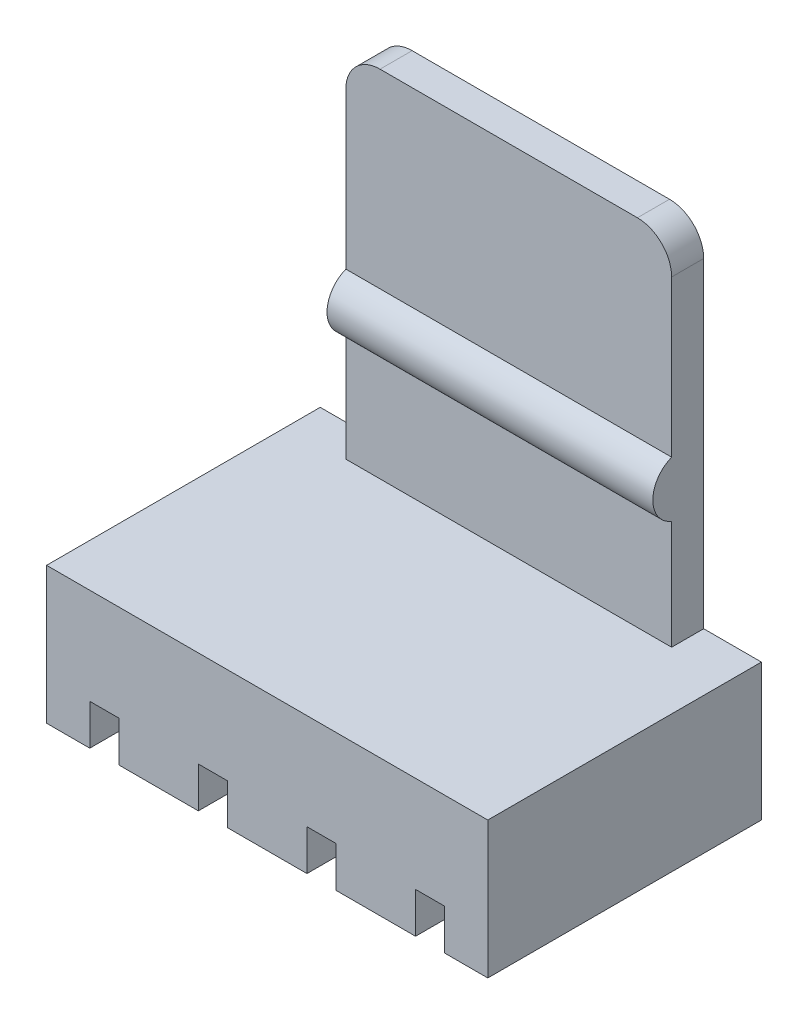
ISO-10303-21;
HEADER;
FILE_DESCRIPTION(('STEP AP214'),'2;1');
FILE_NAME('part.step','',(''),(''),'','','');
FILE_SCHEMA(('AUTOMOTIVE_DESIGN { 1 0 10303 214 1 1 1 1 }'));
ENDSEC;
DATA;
#1=APPLICATION_CONTEXT('core data for automotive mechanical design processes');
#2=APPLICATION_PROTOCOL_DEFINITION('international standard','automotive_design',2000,#1);
#3=PRODUCT_CONTEXT('',#1,'mechanical');
#4=PRODUCT('Part','Part','',(#3));
#5=PRODUCT_RELATED_PRODUCT_CATEGORY('part','',(#4));
#6=PRODUCT_DEFINITION_FORMATION('','',#4);
#7=PRODUCT_DEFINITION_CONTEXT('part definition',#1,'design');
#8=PRODUCT_DEFINITION('design','',#6,#7);
#9=PRODUCT_DEFINITION_SHAPE('','',#8);
#10=(LENGTH_UNIT() NAMED_UNIT(*) SI_UNIT(.MILLI.,.METRE.));
#11=(NAMED_UNIT(*) PLANE_ANGLE_UNIT() SI_UNIT($,.RADIAN.));
#12=(NAMED_UNIT(*) SI_UNIT($,.STERADIAN.) SOLID_ANGLE_UNIT());
#13=UNCERTAINTY_MEASURE_WITH_UNIT(LENGTH_MEASURE(1.E-05),#10,'distance_accuracy_value','');
#14=(GEOMETRIC_REPRESENTATION_CONTEXT(3) GLOBAL_UNCERTAINTY_ASSIGNED_CONTEXT((#13)) GLOBAL_UNIT_ASSIGNED_CONTEXT((#10,
#11,#12)) REPRESENTATION_CONTEXT('',''));
#15=CARTESIAN_POINT('',(0.,0.,0.));
#16=DIRECTION('',(0.,0.,1.));
#17=DIRECTION('',(1.,0.,0.));
#18=AXIS2_PLACEMENT_3D('',#15,#16,#17);
#19=CARTESIAN_POINT('',(3.81,0.95,0.));
#20=DIRECTION('',(0.,1.,0.));
#21=DIRECTION('',(0.,0.,1.));
#22=AXIS2_PLACEMENT_3D('',#19,#20,#21);
#23=PLANE('',#22);
#24=DIRECTION('',(1.,0.,0.));
#25=VECTOR('',#24,1.);
#26=CARTESIAN_POINT('',(3.81,0.95,3.2));
#27=LINE('',#26,#25);
#28=CARTESIAN_POINT('',(3.47,0.95,3.2));
#29=VERTEX_POINT('',#28);
#30=CARTESIAN_POINT('',(4.15,0.95,3.2));
#31=VERTEX_POINT('',#30);
#32=EDGE_CURVE('E396',#29,#31,#27,.T.);
#33=ORIENTED_EDGE('',*,*,#32,.F.);
#34=DIRECTION('',(0.,0.,1.));
#35=VECTOR('',#34,1.);
#36=CARTESIAN_POINT('',(3.47,0.95,-3.2));
#37=LINE('',#36,#35);
#38=CARTESIAN_POINT('',(3.47,0.95,-3.2));
#39=VERTEX_POINT('',#38);
#40=EDGE_CURVE('E343',#29,#39,#37,.F.);
#41=ORIENTED_EDGE('',*,*,#40,.T.);
#42=DIRECTION('',(1.,0.,0.));
#43=VECTOR('',#42,1.);
#44=CARTESIAN_POINT('',(3.81,0.95,-3.2));
#45=LINE('',#44,#43);
#46=CARTESIAN_POINT('',(4.15,0.95,-3.2));
#47=VERTEX_POINT('',#46);
#48=EDGE_CURVE('E398',#47,#39,#45,.F.);
#49=ORIENTED_EDGE('',*,*,#48,.F.);
#50=DIRECTION('',(0.,0.,-1.));
#51=VECTOR('',#50,1.);
#52=CARTESIAN_POINT('',(4.15,0.95,3.2));
#53=LINE('',#52,#51);
#54=EDGE_CURVE('E373',#47,#31,#53,.F.);
#55=ORIENTED_EDGE('',*,*,#54,.T.);
#56=EDGE_LOOP('',(#33,#41,#49,#55));
#57=FACE_BOUND('',#56,.T.);
#58=ADVANCED_FACE('F17',(#57),#23,.F.);
#59=CARTESIAN_POINT('',(1.27,0.95,0.));
#60=DIRECTION('',(0.,1.,0.));
#61=DIRECTION('',(0.,0.,1.));
#62=AXIS2_PLACEMENT_3D('',#59,#60,#61);
#63=PLANE('',#62);
#64=DIRECTION('',(1.,0.,0.));
#65=VECTOR('',#64,1.);
#66=CARTESIAN_POINT('',(1.27,0.95,-3.2));
#67=LINE('',#66,#65);
#68=CARTESIAN_POINT('',(1.61,0.95,-3.2));
#69=VERTEX_POINT('',#68);
#70=CARTESIAN_POINT('',(0.93,0.95,-3.2));
#71=VERTEX_POINT('',#70);
#72=EDGE_CURVE('E392',#69,#71,#67,.F.);
#73=ORIENTED_EDGE('',*,*,#72,.F.);
#74=DIRECTION('',(0.,0.,-1.));
#75=VECTOR('',#74,1.);
#76=CARTESIAN_POINT('',(1.61,0.95,3.2));
#77=LINE('',#76,#75);
#78=CARTESIAN_POINT('',(1.61,0.95,3.2));
#79=VERTEX_POINT('',#78);
#80=EDGE_CURVE('E346',#69,#79,#77,.F.);
#81=ORIENTED_EDGE('',*,*,#80,.T.);
#82=DIRECTION('',(1.,0.,0.));
#83=VECTOR('',#82,1.);
#84=CARTESIAN_POINT('',(1.27,0.95,3.2));
#85=LINE('',#84,#83);
#86=CARTESIAN_POINT('',(0.93,0.95,3.2));
#87=VERTEX_POINT('',#86);
#88=EDGE_CURVE('E394',#87,#79,#85,.T.);
#89=ORIENTED_EDGE('',*,*,#88,.F.);
#90=DIRECTION('',(0.,0.,1.));
#91=VECTOR('',#90,1.);
#92=CARTESIAN_POINT('',(0.93,0.95,-3.2));
#93=LINE('',#92,#91);
#94=EDGE_CURVE('E338',#87,#71,#93,.F.);
#95=ORIENTED_EDGE('',*,*,#94,.T.);
#96=EDGE_LOOP('',(#73,#81,#89,#95));
#97=FACE_BOUND('',#96,.T.);
#98=ADVANCED_FACE('F492',(#97),#63,.F.);
#99=CARTESIAN_POINT('',(-3.81,0.95,0.));
#100=DIRECTION('',(0.,1.,0.));
#101=DIRECTION('',(0.,0.,1.));
#102=AXIS2_PLACEMENT_3D('',#99,#100,#101);
#103=PLANE('',#102);
#104=DIRECTION('',(1.,0.,0.));
#105=VECTOR('',#104,1.);
#106=CARTESIAN_POINT('',(-3.81,0.95,-3.2));
#107=LINE('',#106,#105);
#108=CARTESIAN_POINT('',(-3.47,0.95,-3.2));
#109=VERTEX_POINT('',#108);
#110=CARTESIAN_POINT('',(-4.15,0.95,-3.2));
#111=VERTEX_POINT('',#110);
#112=EDGE_CURVE('E388',#109,#111,#107,.F.);
#113=ORIENTED_EDGE('',*,*,#112,.F.);
#114=DIRECTION('',(0.,0.,-1.));
#115=VECTOR('',#114,1.);
#116=CARTESIAN_POINT('',(-3.47,0.95,3.2));
#117=LINE('',#116,#115);
#118=CARTESIAN_POINT('',(-3.47,0.95,3.2));
#119=VERTEX_POINT('',#118);
#120=EDGE_CURVE('E326',#109,#119,#117,.F.);
#121=ORIENTED_EDGE('',*,*,#120,.T.);
#122=DIRECTION('',(1.,0.,0.));
#123=VECTOR('',#122,1.);
#124=CARTESIAN_POINT('',(-3.81,0.95,3.2));
#125=LINE('',#124,#123);
#126=CARTESIAN_POINT('',(-4.15,0.95,3.2));
#127=VERTEX_POINT('',#126);
#128=EDGE_CURVE('E390',#127,#119,#125,.T.);
#129=ORIENTED_EDGE('',*,*,#128,.F.);
#130=DIRECTION('',(0.,0.,1.));
#131=VECTOR('',#130,1.);
#132=CARTESIAN_POINT('',(-4.15,0.95,-3.2));
#133=LINE('',#132,#131);
#134=EDGE_CURVE('E379',#127,#111,#133,.F.);
#135=ORIENTED_EDGE('',*,*,#134,.T.);
#136=EDGE_LOOP('',(#113,#121,#129,#135));
#137=FACE_BOUND('',#136,.T.);
#138=ADVANCED_FACE('F527',(#137),#103,.F.);
#139=CARTESIAN_POINT('',(-1.27,0.95,0.));
#140=DIRECTION('',(0.,1.,0.));
#141=DIRECTION('',(0.,0.,1.));
#142=AXIS2_PLACEMENT_3D('',#139,#140,#141);
#143=PLANE('',#142);
#144=DIRECTION('',(1.,0.,0.));
#145=VECTOR('',#144,1.);
#146=CARTESIAN_POINT('',(-1.27,0.95,3.2));
#147=LINE('',#146,#145);
#148=CARTESIAN_POINT('',(-1.61,0.95,3.2));
#149=VERTEX_POINT('',#148);
#150=CARTESIAN_POINT('',(-0.93,0.95,3.2));
#151=VERTEX_POINT('',#150);
#152=EDGE_CURVE('E384',#149,#151,#147,.T.);
#153=ORIENTED_EDGE('',*,*,#152,.F.);
#154=DIRECTION('',(0.,0.,1.));
#155=VECTOR('',#154,1.);
#156=CARTESIAN_POINT('',(-1.61,0.95,-3.2));
#157=LINE('',#156,#155);
#158=CARTESIAN_POINT('',(-1.61,0.95,-3.2));
#159=VERTEX_POINT('',#158);
#160=EDGE_CURVE('E323',#149,#159,#157,.F.);
#161=ORIENTED_EDGE('',*,*,#160,.T.);
#162=DIRECTION('',(1.,0.,0.));
#163=VECTOR('',#162,1.);
#164=CARTESIAN_POINT('',(-1.27,0.95,-3.2));
#165=LINE('',#164,#163);
#166=CARTESIAN_POINT('',(-0.93,0.95,-3.2));
#167=VERTEX_POINT('',#166);
#168=EDGE_CURVE('E386',#167,#159,#165,.F.);
#169=ORIENTED_EDGE('',*,*,#168,.F.);
#170=DIRECTION('',(0.,0.,-1.));
#171=VECTOR('',#170,1.);
#172=CARTESIAN_POINT('',(-0.93,0.95,3.2));
#173=LINE('',#172,#171);
#174=EDGE_CURVE('E331',#167,#151,#173,.F.);
#175=ORIENTED_EDGE('',*,*,#174,.T.);
#176=EDGE_LOOP('',(#153,#161,#169,#175));
#177=FACE_BOUND('',#176,.T.);
#178=ADVANCED_FACE('F508',(#177),#143,.F.);
#179=CARTESIAN_POINT('',(-4.15,0.,-3.2));
#180=DIRECTION('',(-1.,0.,0.));
#181=DIRECTION('',(0.,0.,1.));
#182=AXIS2_PLACEMENT_3D('',#179,#180,#181);
#183=PLANE('',#182);
#184=DIRECTION('',(0.,1.,0.));
#185=VECTOR('',#184,1.);
#186=CARTESIAN_POINT('',(-4.15,0.,-3.2));
#187=LINE('',#186,#185);
#188=CARTESIAN_POINT('',(-4.15,0.,-3.2));
#189=VERTEX_POINT('',#188);
#190=EDGE_CURVE('E210',#111,#189,#187,.F.);
#191=ORIENTED_EDGE('',*,*,#190,.F.);
#192=ORIENTED_EDGE('',*,*,#134,.F.);
#193=DIRECTION('',(0.,1.,0.));
#194=VECTOR('',#193,1.);
#195=CARTESIAN_POINT('',(-4.15,0.,3.2));
#196=LINE('',#195,#194);
#197=CARTESIAN_POINT('',(-4.15,0.,3.2));
#198=VERTEX_POINT('',#197);
#199=EDGE_CURVE('E382',#198,#127,#196,.T.);
#200=ORIENTED_EDGE('',*,*,#199,.F.);
#201=DIRECTION('',(0.,0.,1.));
#202=VECTOR('',#201,1.);
#203=CARTESIAN_POINT('',(-4.15,0.,0.));
#204=LINE('',#203,#202);
#205=EDGE_CURVE('E218',#198,#189,#204,.F.);
#206=ORIENTED_EDGE('',*,*,#205,.T.);
#207=EDGE_LOOP('',(#191,#192,#200,#206));
#208=FACE_BOUND('',#207,.T.);
#209=ADVANCED_FACE('F533',(#208),#183,.F.);
#210=CARTESIAN_POINT('',(1.905,6.4,-2.70980762113533));
#211=DIRECTION('',(1.,0.,0.));
#212=DIRECTION('',(0.,1.,0.));
#213=AXIS2_PLACEMENT_3D('',#210,#211,#212);
#214=CYLINDRICAL_SURFACE('',#213,0.7);
#215=CARTESIAN_POINT('',(3.81,6.4,-2.70980762113533));
#216=DIRECTION('',(1.,0.,0.));
#217=DIRECTION('',(0.,1.,0.));
#218=AXIS2_PLACEMENT_3D('',#215,#216,#217);
#219=CIRCLE('',#218,0.7);
#220=CARTESIAN_POINT('',(3.81,5.75,-2.45));
#221=VERTEX_POINT('',#220);
#222=CARTESIAN_POINT('',(3.81,7.05,-2.45));
#223=VERTEX_POINT('',#222);
#224=EDGE_CURVE('E209',#221,#223,#219,.F.);
#225=ORIENTED_EDGE('',*,*,#224,.T.);
#226=DIRECTION('',(1.,0.,0.));
#227=VECTOR('',#226,1.);
#228=CARTESIAN_POINT('',(0.,7.05,-2.45));
#229=LINE('',#228,#227);
#230=CARTESIAN_POINT('',(-3.81,7.05,-2.45));
#231=VERTEX_POINT('',#230);
#232=EDGE_CURVE('E207',#231,#223,#229,.T.);
#233=ORIENTED_EDGE('',*,*,#232,.F.);
#234=CARTESIAN_POINT('',(-3.81,6.4,-2.70980762113533));
#235=DIRECTION('',(1.,0.,0.));
#236=DIRECTION('',(0.,1.,0.));
#237=AXIS2_PLACEMENT_3D('',#234,#235,#236);
#238=CIRCLE('',#237,0.7);
#239=CARTESIAN_POINT('',(-3.81,5.75,-2.45));
#240=VERTEX_POINT('',#239);
#241=EDGE_CURVE('E20',#231,#240,#238,.T.);
#242=ORIENTED_EDGE('',*,*,#241,.T.);
#243=DIRECTION('',(1.,0.,0.));
#244=VECTOR('',#243,1.);
#245=CARTESIAN_POINT('',(0.,5.75,-2.45));
#246=LINE('',#245,#244);
#247=EDGE_CURVE('E204',#221,#240,#246,.F.);
#248=ORIENTED_EDGE('',*,*,#247,.F.);
#249=EDGE_LOOP('',(#225,#233,#242,#248));
#250=FACE_BOUND('',#249,.T.);
#251=ADVANCED_FACE('F203',(#250),#214,.T.);
#252=CARTESIAN_POINT('',(4.15,0.,3.2));
#253=DIRECTION('',(1.,0.,0.));
#254=DIRECTION('',(0.,0.,-1.));
#255=AXIS2_PLACEMENT_3D('',#252,#253,#254);
#256=PLANE('',#255);
#257=DIRECTION('',(0.,1.,0.));
#258=VECTOR('',#257,1.);
#259=CARTESIAN_POINT('',(4.15,0.,3.2));
#260=LINE('',#259,#258);
#261=CARTESIAN_POINT('',(4.15,0.,3.2));
#262=VERTEX_POINT('',#261);
#263=EDGE_CURVE('E351',#31,#262,#260,.F.);
#264=ORIENTED_EDGE('',*,*,#263,.F.);
#265=ORIENTED_EDGE('',*,*,#54,.F.);
#266=DIRECTION('',(0.,1.,0.));
#267=VECTOR('',#266,1.);
#268=CARTESIAN_POINT('',(4.15,0.,-3.2));
#269=LINE('',#268,#267);
#270=CARTESIAN_POINT('',(4.15,0.,-3.2));
#271=VERTEX_POINT('',#270);
#272=EDGE_CURVE('E376',#271,#47,#269,.T.);
#273=ORIENTED_EDGE('',*,*,#272,.F.);
#274=DIRECTION('',(0.,0.,1.));
#275=VECTOR('',#274,1.);
#276=CARTESIAN_POINT('',(4.15,0.,0.));
#277=LINE('',#276,#275);
#278=EDGE_CURVE('E296',#271,#262,#277,.T.);
#279=ORIENTED_EDGE('',*,*,#278,.T.);
#280=EDGE_LOOP('',(#264,#265,#273,#279));
#281=FACE_BOUND('',#280,.T.);
#282=ADVANCED_FACE('F470',(#281),#256,.F.);
#283=CARTESIAN_POINT('',(1.61,0.,3.2));
#284=DIRECTION('',(1.,0.,0.));
#285=DIRECTION('',(0.,0.,-1.));
#286=AXIS2_PLACEMENT_3D('',#283,#284,#285);
#287=PLANE('',#286);
#288=DIRECTION('',(0.,1.,0.));
#289=VECTOR('',#288,1.);
#290=CARTESIAN_POINT('',(1.61,0.,3.2));
#291=LINE('',#290,#289);
#292=CARTESIAN_POINT('',(1.61,0.,3.2));
#293=VERTEX_POINT('',#292);
#294=EDGE_CURVE('E273',#79,#293,#291,.F.);
#295=ORIENTED_EDGE('',*,*,#294,.F.);
#296=ORIENTED_EDGE('',*,*,#80,.F.);
#297=DIRECTION('',(0.,1.,0.));
#298=VECTOR('',#297,1.);
#299=CARTESIAN_POINT('',(1.61,0.,-3.2));
#300=LINE('',#299,#298);
#301=CARTESIAN_POINT('',(1.61,0.,-3.2));
#302=VERTEX_POINT('',#301);
#303=EDGE_CURVE('E349',#302,#69,#300,.T.);
#304=ORIENTED_EDGE('',*,*,#303,.F.);
#305=DIRECTION('',(0.,0.,1.));
#306=VECTOR('',#305,1.);
#307=CARTESIAN_POINT('',(1.61,0.,0.));
#308=LINE('',#307,#306);
#309=EDGE_CURVE('E268',#302,#293,#308,.T.);
#310=ORIENTED_EDGE('',*,*,#309,.T.);
#311=EDGE_LOOP('',(#295,#296,#304,#310));
#312=FACE_BOUND('',#311,.T.);
#313=ADVANCED_FACE('F488',(#312),#287,.F.);
#314=CARTESIAN_POINT('',(3.47,0.,-3.2));
#315=DIRECTION('',(-1.,0.,0.));
#316=DIRECTION('',(0.,0.,1.));
#317=AXIS2_PLACEMENT_3D('',#314,#315,#316);
#318=PLANE('',#317);
#319=DIRECTION('',(0.,1.,0.));
#320=VECTOR('',#319,1.);
#321=CARTESIAN_POINT('',(3.47,0.,-3.2));
#322=LINE('',#321,#320);
#323=CARTESIAN_POINT('',(3.47,0.,-3.2));
#324=VERTEX_POINT('',#323);
#325=EDGE_CURVE('E341',#39,#324,#322,.F.);
#326=ORIENTED_EDGE('',*,*,#325,.F.);
#327=ORIENTED_EDGE('',*,*,#40,.F.);
#328=DIRECTION('',(0.,1.,0.));
#329=VECTOR('',#328,1.);
#330=CARTESIAN_POINT('',(3.47,0.,3.2));
#331=LINE('',#330,#329);
#332=CARTESIAN_POINT('',(3.47,0.,3.2));
#333=VERTEX_POINT('',#332);
#334=EDGE_CURVE('E270',#333,#29,#331,.T.);
#335=ORIENTED_EDGE('',*,*,#334,.F.);
#336=DIRECTION('',(0.,0.,1.));
#337=VECTOR('',#336,1.);
#338=CARTESIAN_POINT('',(3.47,0.,0.));
#339=LINE('',#338,#337);
#340=EDGE_CURVE('E262',#333,#324,#339,.F.);
#341=ORIENTED_EDGE('',*,*,#340,.T.);
#342=EDGE_LOOP('',(#326,#327,#335,#341));
#343=FACE_BOUND('',#342,.T.);
#344=ADVANCED_FACE('F478',(#343),#318,.F.);
#345=CARTESIAN_POINT('',(0.93,0.,-3.2));
#346=DIRECTION('',(-1.,0.,0.));
#347=DIRECTION('',(0.,0.,1.));
#348=AXIS2_PLACEMENT_3D('',#345,#346,#347);
#349=PLANE('',#348);
#350=DIRECTION('',(0.,1.,0.));
#351=VECTOR('',#350,1.);
#352=CARTESIAN_POINT('',(0.93,0.,-3.2));
#353=LINE('',#352,#351);
#354=CARTESIAN_POINT('',(0.93,0.,-3.2));
#355=VERTEX_POINT('',#354);
#356=EDGE_CURVE('E336',#71,#355,#353,.F.);
#357=ORIENTED_EDGE('',*,*,#356,.F.);
#358=ORIENTED_EDGE('',*,*,#94,.F.);
#359=DIRECTION('',(0.,1.,0.));
#360=VECTOR('',#359,1.);
#361=CARTESIAN_POINT('',(0.93,0.,3.2));
#362=LINE('',#361,#360);
#363=CARTESIAN_POINT('',(0.93,0.,3.2));
#364=VERTEX_POINT('',#363);
#365=EDGE_CURVE('E276',#364,#87,#362,.T.);
#366=ORIENTED_EDGE('',*,*,#365,.F.);
#367=DIRECTION('',(0.,0.,1.));
#368=VECTOR('',#367,1.);
#369=CARTESIAN_POINT('',(0.93,0.,0.));
#370=LINE('',#369,#368);
#371=EDGE_CURVE('E256',#364,#355,#370,.F.);
#372=ORIENTED_EDGE('',*,*,#371,.T.);
#373=EDGE_LOOP('',(#357,#358,#366,#372));
#374=FACE_BOUND('',#373,.T.);
#375=ADVANCED_FACE('F497',(#374),#349,.F.);
#376=CARTESIAN_POINT('',(-0.93,0.,3.2));
#377=DIRECTION('',(1.,0.,0.));
#378=DIRECTION('',(0.,0.,-1.));
#379=AXIS2_PLACEMENT_3D('',#376,#377,#378);
#380=PLANE('',#379);
#381=DIRECTION('',(0.,1.,0.));
#382=VECTOR('',#381,1.);
#383=CARTESIAN_POINT('',(-0.93,0.,3.2));
#384=LINE('',#383,#382);
#385=CARTESIAN_POINT('',(-0.93,0.,3.2));
#386=VERTEX_POINT('',#385);
#387=EDGE_CURVE('E279',#151,#386,#384,.F.);
#388=ORIENTED_EDGE('',*,*,#387,.F.);
#389=ORIENTED_EDGE('',*,*,#174,.F.);
#390=DIRECTION('',(0.,1.,0.));
#391=VECTOR('',#390,1.);
#392=CARTESIAN_POINT('',(-0.93,0.,-3.2));
#393=LINE('',#392,#391);
#394=CARTESIAN_POINT('',(-0.93,0.,-3.2));
#395=VERTEX_POINT('',#394);
#396=EDGE_CURVE('E334',#395,#167,#393,.T.);
#397=ORIENTED_EDGE('',*,*,#396,.F.);
#398=DIRECTION('',(0.,0.,1.));
#399=VECTOR('',#398,1.);
#400=CARTESIAN_POINT('',(-0.93,0.,0.));
#401=LINE('',#400,#399);
#402=EDGE_CURVE('E253',#395,#386,#401,.T.);
#403=ORIENTED_EDGE('',*,*,#402,.T.);
#404=EDGE_LOOP('',(#388,#389,#397,#403));
#405=FACE_BOUND('',#404,.T.);
#406=ADVANCED_FACE('F504',(#405),#380,.F.);
#407=CARTESIAN_POINT('',(-3.47,0.,3.2));
#408=DIRECTION('',(1.,0.,0.));
#409=DIRECTION('',(0.,0.,-1.));
#410=AXIS2_PLACEMENT_3D('',#407,#408,#409);
#411=PLANE('',#410);
#412=DIRECTION('',(0.,1.,0.));
#413=VECTOR('',#412,1.);
#414=CARTESIAN_POINT('',(-3.47,0.,3.2));
#415=LINE('',#414,#413);
#416=CARTESIAN_POINT('',(-3.47,0.,3.2));
#417=VERTEX_POINT('',#416);
#418=EDGE_CURVE('E284',#119,#417,#415,.F.);
#419=ORIENTED_EDGE('',*,*,#418,.F.);
#420=ORIENTED_EDGE('',*,*,#120,.F.);
#421=DIRECTION('',(0.,1.,0.));
#422=VECTOR('',#421,1.);
#423=CARTESIAN_POINT('',(-3.47,0.,-3.2));
#424=LINE('',#423,#422);
#425=CARTESIAN_POINT('',(-3.47,0.,-3.2));
#426=VERTEX_POINT('',#425);
#427=EDGE_CURVE('E329',#426,#109,#424,.T.);
#428=ORIENTED_EDGE('',*,*,#427,.F.);
#429=DIRECTION('',(0.,0.,1.));
#430=VECTOR('',#429,1.);
#431=CARTESIAN_POINT('',(-3.47,0.,0.));
#432=LINE('',#431,#430);
#433=EDGE_CURVE('E251',#426,#417,#432,.T.);
#434=ORIENTED_EDGE('',*,*,#433,.T.);
#435=EDGE_LOOP('',(#419,#420,#428,#434));
#436=FACE_BOUND('',#435,.T.);
#437=ADVANCED_FACE('F522',(#436),#411,.F.);
#438=CARTESIAN_POINT('',(-1.61,0.,-3.2));
#439=DIRECTION('',(-1.,0.,0.));
#440=DIRECTION('',(0.,0.,1.));
#441=AXIS2_PLACEMENT_3D('',#438,#439,#440);
#442=PLANE('',#441);
#443=DIRECTION('',(0.,1.,0.));
#444=VECTOR('',#443,1.);
#445=CARTESIAN_POINT('',(-1.61,0.,-3.2));
#446=LINE('',#445,#444);
#447=CARTESIAN_POINT('',(-1.61,0.,-3.2));
#448=VERTEX_POINT('',#447);
#449=EDGE_CURVE('E321',#159,#448,#446,.F.);
#450=ORIENTED_EDGE('',*,*,#449,.F.);
#451=ORIENTED_EDGE('',*,*,#160,.F.);
#452=DIRECTION('',(0.,1.,0.));
#453=VECTOR('',#452,1.);
#454=CARTESIAN_POINT('',(-1.61,0.,3.2));
#455=LINE('',#454,#453);
#456=CARTESIAN_POINT('',(-1.61,0.,3.2));
#457=VERTEX_POINT('',#456);
#458=EDGE_CURVE('E281',#457,#149,#455,.T.);
#459=ORIENTED_EDGE('',*,*,#458,.F.);
#460=DIRECTION('',(0.,0.,1.));
#461=VECTOR('',#460,1.);
#462=CARTESIAN_POINT('',(-1.61,0.,0.));
#463=LINE('',#462,#461);
#464=EDGE_CURVE('E245',#457,#448,#463,.F.);
#465=ORIENTED_EDGE('',*,*,#464,.T.);
#466=EDGE_LOOP('',(#450,#451,#459,#465));
#467=FACE_BOUND('',#466,.T.);
#468=ADVANCED_FACE('F512',(#467),#442,.F.);
#469=CARTESIAN_POINT('',(0.,0.,0.));
#470=DIRECTION('',(0.,1.,0.));
#471=DIRECTION('',(0.,0.,1.));
#472=AXIS2_PLACEMENT_3D('',#469,#470,#471);
#473=PLANE('',#472);
#474=DIRECTION('',(1.,0.,0.));
#475=VECTOR('',#474,1.);
#476=CARTESIAN_POINT('',(-5.16,0.,3.2));
#477=LINE('',#476,#475);
#478=CARTESIAN_POINT('',(-5.16,0.,3.2));
#479=VERTEX_POINT('',#478);
#480=EDGE_CURVE('E287',#479,#198,#477,.T.);
#481=ORIENTED_EDGE('',*,*,#480,.F.);
#482=DIRECTION('',(0.,0.,1.));
#483=VECTOR('',#482,1.);
#484=CARTESIAN_POINT('',(-5.16,0.,-3.2));
#485=LINE('',#484,#483);
#486=CARTESIAN_POINT('',(-5.16,0.,-3.2));
#487=VERTEX_POINT('',#486);
#488=EDGE_CURVE('E242',#487,#479,#485,.T.);
#489=ORIENTED_EDGE('',*,*,#488,.F.);
#490=DIRECTION('',(1.,0.,0.));
#491=VECTOR('',#490,1.);
#492=CARTESIAN_POINT('',(0.,0.,-3.2));
#493=LINE('',#492,#491);
#494=EDGE_CURVE('E319',#189,#487,#493,.F.);
#495=ORIENTED_EDGE('',*,*,#494,.F.);
#496=ORIENTED_EDGE('',*,*,#205,.F.);
#497=EDGE_LOOP('',(#481,#489,#495,#496));
#498=FACE_BOUND('',#497,.T.);
#499=ADVANCED_FACE('F535',(#498),#473,.F.);
#500=CARTESIAN_POINT('',(0.,7.35,-2.45));
#501=DIRECTION('',(0.,0.,1.));
#502=DIRECTION('',(1.,0.,0.));
#503=AXIS2_PLACEMENT_3D('',#500,#501,#502);
#504=PLANE('',#503);
#505=DIRECTION('',(1.,0.,0.));
#506=VECTOR('',#505,1.);
#507=CARTESIAN_POINT('',(0.,3.2,-2.45));
#508=LINE('',#507,#506);
#509=CARTESIAN_POINT('',(3.81,3.2,-2.45));
#510=VERTEX_POINT('',#509);
#511=CARTESIAN_POINT('',(-3.81,3.2,-2.45));
#512=VERTEX_POINT('',#511);
#513=EDGE_CURVE('E295',#510,#512,#508,.F.);
#514=ORIENTED_EDGE('',*,*,#513,.F.);
#515=DIRECTION('',(0.,1.,0.));
#516=VECTOR('',#515,1.);
#517=CARTESIAN_POINT('',(3.81,3.2,-2.45));
#518=LINE('',#517,#516);
#519=EDGE_CURVE('E217',#221,#510,#518,.F.);
#520=ORIENTED_EDGE('',*,*,#519,.F.);
#521=ORIENTED_EDGE('',*,*,#247,.T.);
#522=DIRECTION('',(0.,-1.,0.));
#523=VECTOR('',#522,1.);
#524=CARTESIAN_POINT('',(-3.81,11.5,-2.45));
#525=LINE('',#524,#523);
#526=EDGE_CURVE('E214',#512,#240,#525,.F.);
#527=ORIENTED_EDGE('',*,*,#526,.F.);
#528=EDGE_LOOP('',(#514,#520,#521,#527));
#529=FACE_BOUND('',#528,.T.);
#530=ADVANCED_FACE('F213',(#529),#504,.T.);
#531=CARTESIAN_POINT('',(0.,7.35,-2.45));
#532=DIRECTION('',(0.,0.,1.));
#533=DIRECTION('',(1.,0.,0.));
#534=AXIS2_PLACEMENT_3D('',#531,#532,#533);
#535=PLANE('',#534);
#536=CARTESIAN_POINT('',(-3.01,10.7,-2.45));
#537=DIRECTION('',(0.,0.,1.));
#538=DIRECTION('',(1.,0.,0.));
#539=AXIS2_PLACEMENT_3D('',#536,#537,#538);
#540=CIRCLE('',#539,0.8);
#541=CARTESIAN_POINT('',(-3.81,10.7,-2.45));
#542=VERTEX_POINT('',#541);
#543=CARTESIAN_POINT('',(-3.01,11.5,-2.45));
#544=VERTEX_POINT('',#543);
#545=EDGE_CURVE('E224',#542,#544,#540,.F.);
#546=ORIENTED_EDGE('',*,*,#545,.F.);
#547=DIRECTION('',(0.,-1.,0.));
#548=VECTOR('',#547,1.);
#549=CARTESIAN_POINT('',(-3.81,11.5,-2.45));
#550=LINE('',#549,#548);
#551=EDGE_CURVE('E228',#231,#542,#550,.F.);
#552=ORIENTED_EDGE('',*,*,#551,.F.);
#553=ORIENTED_EDGE('',*,*,#232,.T.);
#554=DIRECTION('',(0.,1.,0.));
#555=VECTOR('',#554,1.);
#556=CARTESIAN_POINT('',(3.81,3.2,-2.45));
#557=LINE('',#556,#555);
#558=CARTESIAN_POINT('',(3.81,10.7,-2.45));
#559=VERTEX_POINT('',#558);
#560=EDGE_CURVE('E413',#559,#223,#557,.F.);
#561=ORIENTED_EDGE('',*,*,#560,.F.);
#562=CARTESIAN_POINT('',(3.01,10.7,-2.45));
#563=DIRECTION('',(0.,0.,1.));
#564=DIRECTION('',(1.,0.,0.));
#565=AXIS2_PLACEMENT_3D('',#562,#563,#564);
#566=CIRCLE('',#565,0.8);
#567=CARTESIAN_POINT('',(3.01,11.5,-2.45));
#568=VERTEX_POINT('',#567);
#569=EDGE_CURVE('E312',#568,#559,#566,.F.);
#570=ORIENTED_EDGE('',*,*,#569,.F.);
#571=DIRECTION('',(1.,0.,0.));
#572=VECTOR('',#571,1.);
#573=CARTESIAN_POINT('',(3.81,11.5,-2.45));
#574=LINE('',#573,#572);
#575=EDGE_CURVE('E309',#544,#568,#574,.T.);
#576=ORIENTED_EDGE('',*,*,#575,.F.);
#577=EDGE_LOOP('',(#546,#552,#553,#561,#570,#576));
#578=FACE_BOUND('',#577,.T.);
#579=ADVANCED_FACE('F412',(#578),#535,.T.);
#580=CARTESIAN_POINT('',(0.,0.,0.));
#581=DIRECTION('',(0.,1.,0.));
#582=DIRECTION('',(0.,0.,1.));
#583=AXIS2_PLACEMENT_3D('',#580,#581,#582);
#584=PLANE('',#583);
#585=DIRECTION('',(1.,0.,0.));
#586=VECTOR('',#585,1.);
#587=CARTESIAN_POINT('',(0.,0.,-3.2));
#588=LINE('',#587,#586);
#589=CARTESIAN_POINT('',(5.16,0.,-3.2));
#590=VERTEX_POINT('',#589);
#591=EDGE_CURVE('E35',#590,#271,#588,.F.);
#592=ORIENTED_EDGE('',*,*,#591,.F.);
#593=DIRECTION('',(0.,0.,-1.));
#594=VECTOR('',#593,1.);
#595=CARTESIAN_POINT('',(5.16,0.,3.2));
#596=LINE('',#595,#594);
#597=CARTESIAN_POINT('',(5.16,0.,3.2));
#598=VERTEX_POINT('',#597);
#599=EDGE_CURVE('E356',#598,#590,#596,.T.);
#600=ORIENTED_EDGE('',*,*,#599,.F.);
#601=DIRECTION('',(1.,0.,0.));
#602=VECTOR('',#601,1.);
#603=CARTESIAN_POINT('',(-5.16,0.,3.2));
#604=LINE('',#603,#602);
#605=EDGE_CURVE('E292',#262,#598,#604,.T.);
#606=ORIENTED_EDGE('',*,*,#605,.F.);
#607=ORIENTED_EDGE('',*,*,#278,.F.);
#608=EDGE_LOOP('',(#592,#600,#606,#607));
#609=FACE_BOUND('',#608,.T.);
#610=ADVANCED_FACE('F467',(#609),#584,.F.);
#611=CARTESIAN_POINT('',(0.,3.2,0.));
#612=DIRECTION('',(0.,1.,0.));
#613=DIRECTION('',(0.,0.,1.));
#614=AXIS2_PLACEMENT_3D('',#611,#612,#613);
#615=PLANE('',#614);
#616=DIRECTION('',(0.,0.,-1.));
#617=VECTOR('',#616,1.);
#618=CARTESIAN_POINT('',(3.81,3.2,-3.2));
#619=LINE('',#618,#617);
#620=CARTESIAN_POINT('',(3.81,3.2,-3.2));
#621=VERTEX_POINT('',#620);
#622=EDGE_CURVE('E420',#510,#621,#619,.T.);
#623=ORIENTED_EDGE('',*,*,#622,.F.);
#624=ORIENTED_EDGE('',*,*,#513,.T.);
#625=DIRECTION('',(0.,0.,1.));
#626=VECTOR('',#625,1.);
#627=CARTESIAN_POINT('',(-3.81,3.2,-3.2));
#628=LINE('',#627,#626);
#629=CARTESIAN_POINT('',(-3.81,3.2,-3.2));
#630=VERTEX_POINT('',#629);
#631=EDGE_CURVE('E223',#630,#512,#628,.T.);
#632=ORIENTED_EDGE('',*,*,#631,.F.);
#633=DIRECTION('',(1.,0.,0.));
#634=VECTOR('',#633,1.);
#635=CARTESIAN_POINT('',(0.,3.2,-3.2));
#636=LINE('',#635,#634);
#637=CARTESIAN_POINT('',(-5.16,3.2,-3.2));
#638=VERTEX_POINT('',#637);
#639=EDGE_CURVE('E299',#630,#638,#636,.F.);
#640=ORIENTED_EDGE('',*,*,#639,.T.);
#641=DIRECTION('',(0.,0.,1.));
#642=VECTOR('',#641,1.);
#643=CARTESIAN_POINT('',(-5.16,3.2,-3.2));
#644=LINE('',#643,#642);
#645=CARTESIAN_POINT('',(-5.16,3.2,3.2));
#646=VERTEX_POINT('',#645);
#647=EDGE_CURVE('E235',#646,#638,#644,.F.);
#648=ORIENTED_EDGE('',*,*,#647,.F.);
#649=DIRECTION('',(1.,0.,0.));
#650=VECTOR('',#649,1.);
#651=CARTESIAN_POINT('',(-5.16,3.2,3.2));
#652=LINE('',#651,#650);
#653=CARTESIAN_POINT('',(5.16,3.2,3.2));
#654=VERTEX_POINT('',#653);
#655=EDGE_CURVE('E290',#654,#646,#652,.F.);
#656=ORIENTED_EDGE('',*,*,#655,.F.);
#657=DIRECTION('',(0.,0.,-1.));
#658=VECTOR('',#657,1.);
#659=CARTESIAN_POINT('',(5.16,3.2,3.2));
#660=LINE('',#659,#658);
#661=CARTESIAN_POINT('',(5.16,3.2,-3.2));
#662=VERTEX_POINT('',#661);
#663=EDGE_CURVE('E352',#662,#654,#660,.F.);
#664=ORIENTED_EDGE('',*,*,#663,.F.);
#665=DIRECTION('',(1.,0.,0.));
#666=VECTOR('',#665,1.);
#667=CARTESIAN_POINT('',(0.,3.2,-3.2));
#668=LINE('',#667,#666);
#669=EDGE_CURVE('E302',#662,#621,#668,.F.);
#670=ORIENTED_EDGE('',*,*,#669,.T.);
#671=EDGE_LOOP('',(#623,#624,#632,#640,#648,#656,#664,#670));
#672=FACE_BOUND('',#671,.T.);
#673=ADVANCED_FACE('F541',(#672),#615,.T.);
#674=CARTESIAN_POINT('',(-5.16,0.,3.2));
#675=DIRECTION('',(0.,0.,1.));
#676=DIRECTION('',(1.,0.,0.));
#677=AXIS2_PLACEMENT_3D('',#674,#675,#676);
#678=PLANE('',#677);
#679=ORIENTED_EDGE('',*,*,#334,.T.);
#680=ORIENTED_EDGE('',*,*,#32,.T.);
#681=ORIENTED_EDGE('',*,*,#263,.T.);
#682=ORIENTED_EDGE('',*,*,#605,.T.);
#683=DIRECTION('',(0.,1.,0.));
#684=VECTOR('',#683,1.);
#685=CARTESIAN_POINT('',(5.16,0.,3.2));
#686=LINE('',#685,#684);
#687=EDGE_CURVE('E355',#654,#598,#686,.F.);
#688=ORIENTED_EDGE('',*,*,#687,.F.);
#689=ORIENTED_EDGE('',*,*,#655,.T.);
#690=DIRECTION('',(0.,1.,0.));
#691=VECTOR('',#690,1.);
#692=CARTESIAN_POINT('',(-5.16,0.,3.2));
#693=LINE('',#692,#691);
#694=EDGE_CURVE('E239',#479,#646,#693,.T.);
#695=ORIENTED_EDGE('',*,*,#694,.F.);
#696=ORIENTED_EDGE('',*,*,#480,.T.);
#697=ORIENTED_EDGE('',*,*,#199,.T.);
#698=ORIENTED_EDGE('',*,*,#128,.T.);
#699=ORIENTED_EDGE('',*,*,#418,.T.);
#700=DIRECTION('',(1.,0.,0.));
#701=VECTOR('',#700,1.);
#702=CARTESIAN_POINT('',(0.,0.,3.2));
#703=LINE('',#702,#701);
#704=EDGE_CURVE('E248',#417,#457,#703,.T.);
#705=ORIENTED_EDGE('',*,*,#704,.T.);
#706=ORIENTED_EDGE('',*,*,#458,.T.);
#707=ORIENTED_EDGE('',*,*,#152,.T.);
#708=ORIENTED_EDGE('',*,*,#387,.T.);
#709=DIRECTION('',(1.,0.,0.));
#710=VECTOR('',#709,1.);
#711=CARTESIAN_POINT('',(0.,0.,3.2));
#712=LINE('',#711,#710);
#713=EDGE_CURVE('E259',#386,#364,#712,.T.);
#714=ORIENTED_EDGE('',*,*,#713,.T.);
#715=ORIENTED_EDGE('',*,*,#365,.T.);
#716=ORIENTED_EDGE('',*,*,#88,.T.);
#717=ORIENTED_EDGE('',*,*,#294,.T.);
#718=DIRECTION('',(1.,0.,0.));
#719=VECTOR('',#718,1.);
#720=CARTESIAN_POINT('',(0.,0.,3.2));
#721=LINE('',#720,#719);
#722=EDGE_CURVE('E265',#293,#333,#721,.T.);
#723=ORIENTED_EDGE('',*,*,#722,.T.);
#724=EDGE_LOOP('',(#679,#680,#681,#682,#688,#689,#695,#696,#697,#698,#699,#705,#706,#707,#708,
#714,#715,#716,#717,#723));
#725=FACE_BOUND('',#724,.T.);
#726=ADVANCED_FACE('F462',(#725),#678,.T.);
#727=CARTESIAN_POINT('',(0.,0.,0.));
#728=DIRECTION('',(0.,1.,0.));
#729=DIRECTION('',(0.,0.,1.));
#730=AXIS2_PLACEMENT_3D('',#727,#728,#729);
#731=PLANE('',#730);
#732=ORIENTED_EDGE('',*,*,#722,.F.);
#733=ORIENTED_EDGE('',*,*,#309,.F.);
#734=DIRECTION('',(-1.,0.,0.));
#735=VECTOR('',#734,1.);
#736=CARTESIAN_POINT('',(5.16,0.,-3.2));
#737=LINE('',#736,#735);
#738=EDGE_CURVE('E453',#324,#302,#737,.T.);
#739=ORIENTED_EDGE('',*,*,#738,.F.);
#740=ORIENTED_EDGE('',*,*,#340,.F.);
#741=EDGE_LOOP('',(#732,#733,#739,#740));
#742=FACE_BOUND('',#741,.T.);
#743=ADVANCED_FACE('F485',(#742),#731,.F.);
#744=CARTESIAN_POINT('',(0.,0.,0.));
#745=DIRECTION('',(0.,1.,0.));
#746=DIRECTION('',(0.,0.,1.));
#747=AXIS2_PLACEMENT_3D('',#744,#745,#746);
#748=PLANE('',#747);
#749=DIRECTION('',(-1.,0.,0.));
#750=VECTOR('',#749,1.);
#751=CARTESIAN_POINT('',(5.16,0.,-3.2));
#752=LINE('',#751,#750);
#753=EDGE_CURVE('E450',#355,#395,#752,.T.);
#754=ORIENTED_EDGE('',*,*,#753,.F.);
#755=ORIENTED_EDGE('',*,*,#371,.F.);
#756=ORIENTED_EDGE('',*,*,#713,.F.);
#757=ORIENTED_EDGE('',*,*,#402,.F.);
#758=EDGE_LOOP('',(#754,#755,#756,#757));
#759=FACE_BOUND('',#758,.T.);
#760=ADVANCED_FACE('F501',(#759),#748,.F.);
#761=CARTESIAN_POINT('',(0.,0.,0.));
#762=DIRECTION('',(0.,1.,0.));
#763=DIRECTION('',(0.,0.,1.));
#764=AXIS2_PLACEMENT_3D('',#761,#762,#763);
#765=PLANE('',#764);
#766=ORIENTED_EDGE('',*,*,#704,.F.);
#767=ORIENTED_EDGE('',*,*,#433,.F.);
#768=DIRECTION('',(-1.,0.,0.));
#769=VECTOR('',#768,1.);
#770=CARTESIAN_POINT('',(5.16,0.,-3.2));
#771=LINE('',#770,#769);
#772=EDGE_CURVE('E369',#448,#426,#771,.T.);
#773=ORIENTED_EDGE('',*,*,#772,.F.);
#774=ORIENTED_EDGE('',*,*,#464,.F.);
#775=EDGE_LOOP('',(#766,#767,#773,#774));
#776=FACE_BOUND('',#775,.T.);
#777=ADVANCED_FACE('F519',(#776),#765,.F.);
#778=CARTESIAN_POINT('',(-5.16,0.,-3.2));
#779=DIRECTION('',(-1.,0.,0.));
#780=DIRECTION('',(0.,0.,1.));
#781=AXIS2_PLACEMENT_3D('',#778,#779,#780);
#782=PLANE('',#781);
#783=ORIENTED_EDGE('',*,*,#647,.T.);
#784=DIRECTION('',(0.,1.,0.));
#785=VECTOR('',#784,1.);
#786=CARTESIAN_POINT('',(-5.16,0.,-3.2));
#787=LINE('',#786,#785);
#788=EDGE_CURVE('E365',#487,#638,#787,.T.);
#789=ORIENTED_EDGE('',*,*,#788,.F.);
#790=ORIENTED_EDGE('',*,*,#488,.T.);
#791=ORIENTED_EDGE('',*,*,#694,.T.);
#792=EDGE_LOOP('',(#783,#789,#790,#791));
#793=FACE_BOUND('',#792,.T.);
#794=ADVANCED_FACE('F538',(#793),#782,.T.);
#795=CARTESIAN_POINT('',(-3.81,11.5,-3.2));
#796=DIRECTION('',(-1.,0.,0.));
#797=DIRECTION('',(0.,-1.,0.));
#798=AXIS2_PLACEMENT_3D('',#795,#796,#797);
#799=PLANE('',#798);
#800=ORIENTED_EDGE('',*,*,#631,.T.);
#801=ORIENTED_EDGE('',*,*,#526,.T.);
#802=ORIENTED_EDGE('',*,*,#241,.F.);
#803=ORIENTED_EDGE('',*,*,#551,.T.);
#804=DIRECTION('',(0.,0.,1.));
#805=VECTOR('',#804,1.);
#806=CARTESIAN_POINT('',(-3.81,10.7,-3.2));
#807=LINE('',#806,#805);
#808=CARTESIAN_POINT('',(-3.81,10.7,-3.2));
#809=VERTEX_POINT('',#808);
#810=EDGE_CURVE('E226',#809,#542,#807,.T.);
#811=ORIENTED_EDGE('',*,*,#810,.F.);
#812=DIRECTION('',(0.,1.,0.));
#813=VECTOR('',#812,1.);
#814=CARTESIAN_POINT('',(-3.81,0.,-3.2));
#815=LINE('',#814,#813);
#816=EDGE_CURVE('E368',#630,#809,#815,.T.);
#817=ORIENTED_EDGE('',*,*,#816,.F.);
#818=EDGE_LOOP('',(#800,#801,#802,#803,#811,#817));
#819=FACE_BOUND('',#818,.T.);
#820=ADVANCED_FACE('F220',(#819),#799,.T.);
#821=CARTESIAN_POINT('',(-3.01,10.7,-3.2));
#822=DIRECTION('',(0.,0.,1.));
#823=DIRECTION('',(1.,0.,0.));
#824=AXIS2_PLACEMENT_3D('',#821,#822,#823);
#825=CYLINDRICAL_SURFACE('',#824,0.8);
#826=CARTESIAN_POINT('',(-3.01,10.7,-3.2));
#827=DIRECTION('',(0.,0.,1.));
#828=DIRECTION('',(1.,0.,0.));
#829=AXIS2_PLACEMENT_3D('',#826,#827,#828);
#830=CIRCLE('',#829,0.8);
#831=CARTESIAN_POINT('',(-3.01,11.5,-3.2));
#832=VERTEX_POINT('',#831);
#833=EDGE_CURVE('E404',#809,#832,#830,.F.);
#834=ORIENTED_EDGE('',*,*,#833,.F.);
#835=ORIENTED_EDGE('',*,*,#810,.T.);
#836=ORIENTED_EDGE('',*,*,#545,.T.);
#837=DIRECTION('',(0.,0.,1.));
#838=VECTOR('',#837,1.);
#839=CARTESIAN_POINT('',(-3.01,11.5,-3.2));
#840=LINE('',#839,#838);
#841=EDGE_CURVE('E313',#832,#544,#840,.T.);
#842=ORIENTED_EDGE('',*,*,#841,.F.);
#843=EDGE_LOOP('',(#834,#835,#836,#842));
#844=FACE_BOUND('',#843,.T.);
#845=ADVANCED_FACE('F438',(#844),#825,.T.);
#846=CARTESIAN_POINT('',(3.81,11.5,-3.2));
#847=DIRECTION('',(0.,1.,0.));
#848=DIRECTION('',(0.,0.,1.));
#849=AXIS2_PLACEMENT_3D('',#846,#847,#848);
#850=PLANE('',#849);
#851=DIRECTION('',(0.,0.,1.));
#852=VECTOR('',#851,1.);
#853=CARTESIAN_POINT('',(3.01,11.5,-3.2));
#854=LINE('',#853,#852);
#855=CARTESIAN_POINT('',(3.01,11.5,-3.2));
#856=VERTEX_POINT('',#855);
#857=EDGE_CURVE('E407',#856,#568,#854,.T.);
#858=ORIENTED_EDGE('',*,*,#857,.F.);
#859=DIRECTION('',(-1.,0.,0.));
#860=VECTOR('',#859,1.);
#861=CARTESIAN_POINT('',(5.16,11.5,-3.2));
#862=LINE('',#861,#860);
#863=EDGE_CURVE('E403',#832,#856,#862,.F.);
#864=ORIENTED_EDGE('',*,*,#863,.F.);
#865=ORIENTED_EDGE('',*,*,#841,.T.);
#866=ORIENTED_EDGE('',*,*,#575,.T.);
#867=EDGE_LOOP('',(#858,#864,#865,#866));
#868=FACE_BOUND('',#867,.T.);
#869=ADVANCED_FACE('F549',(#868),#850,.T.);
#870=CARTESIAN_POINT('',(3.01,10.7,-3.2));
#871=DIRECTION('',(0.,0.,1.));
#872=DIRECTION('',(1.,0.,0.));
#873=AXIS2_PLACEMENT_3D('',#870,#871,#872);
#874=CYLINDRICAL_SURFACE('',#873,0.8);
#875=CARTESIAN_POINT('',(3.01,10.7,-3.2));
#876=DIRECTION('',(0.,0.,1.));
#877=DIRECTION('',(1.,0.,0.));
#878=AXIS2_PLACEMENT_3D('',#875,#876,#877);
#879=CIRCLE('',#878,0.8);
#880=CARTESIAN_POINT('',(3.81,10.7,-3.2));
#881=VERTEX_POINT('',#880);
#882=EDGE_CURVE('E400',#856,#881,#879,.F.);
#883=ORIENTED_EDGE('',*,*,#882,.F.);
#884=ORIENTED_EDGE('',*,*,#857,.T.);
#885=ORIENTED_EDGE('',*,*,#569,.T.);
#886=DIRECTION('',(0.,0.,-1.));
#887=VECTOR('',#886,1.);
#888=CARTESIAN_POINT('',(3.81,10.7,-3.2));
#889=LINE('',#888,#887);
#890=EDGE_CURVE('E417',#881,#559,#889,.F.);
#891=ORIENTED_EDGE('',*,*,#890,.F.);
#892=EDGE_LOOP('',(#883,#884,#885,#891));
#893=FACE_BOUND('',#892,.T.);
#894=ADVANCED_FACE('F548',(#893),#874,.T.);
#895=CARTESIAN_POINT('',(3.81,3.2,-3.2));
#896=DIRECTION('',(1.,0.,0.));
#897=DIRECTION('',(0.,0.,-1.));
#898=AXIS2_PLACEMENT_3D('',#895,#896,#897);
#899=PLANE('',#898);
#900=ORIENTED_EDGE('',*,*,#890,.T.);
#901=ORIENTED_EDGE('',*,*,#560,.T.);
#902=ORIENTED_EDGE('',*,*,#224,.F.);
#903=ORIENTED_EDGE('',*,*,#519,.T.);
#904=ORIENTED_EDGE('',*,*,#622,.T.);
#905=DIRECTION('',(0.,1.,0.));
#906=VECTOR('',#905,1.);
#907=CARTESIAN_POINT('',(3.81,0.,-3.2));
#908=LINE('',#907,#906);
#909=EDGE_CURVE('E26',#881,#621,#908,.F.);
#910=ORIENTED_EDGE('',*,*,#909,.F.);
#911=EDGE_LOOP('',(#900,#901,#902,#903,#904,#910));
#912=FACE_BOUND('',#911,.T.);
#913=ADVANCED_FACE('F415',(#912),#899,.T.);
#914=CARTESIAN_POINT('',(5.16,0.,3.2));
#915=DIRECTION('',(1.,0.,0.));
#916=DIRECTION('',(0.,0.,-1.));
#917=AXIS2_PLACEMENT_3D('',#914,#915,#916);
#918=PLANE('',#917);
#919=ORIENTED_EDGE('',*,*,#663,.T.);
#920=ORIENTED_EDGE('',*,*,#687,.T.);
#921=ORIENTED_EDGE('',*,*,#599,.T.);
#922=DIRECTION('',(0.,1.,0.));
#923=VECTOR('',#922,1.);
#924=CARTESIAN_POINT('',(5.16,0.,-3.2));
#925=LINE('',#924,#923);
#926=EDGE_CURVE('E11',#662,#590,#925,.F.);
#927=ORIENTED_EDGE('',*,*,#926,.F.);
#928=EDGE_LOOP('',(#919,#920,#921,#927));
#929=FACE_BOUND('',#928,.T.);
#930=ADVANCED_FACE('F458',(#929),#918,.T.);
#931=CARTESIAN_POINT('',(5.16,0.,-3.2));
#932=DIRECTION('',(0.,0.,-1.));
#933=DIRECTION('',(-1.,0.,0.));
#934=AXIS2_PLACEMENT_3D('',#931,#932,#933);
#935=PLANE('',#934);
#936=ORIENTED_EDGE('',*,*,#926,.T.);
#937=ORIENTED_EDGE('',*,*,#591,.T.);
#938=ORIENTED_EDGE('',*,*,#272,.T.);
#939=ORIENTED_EDGE('',*,*,#48,.T.);
#940=ORIENTED_EDGE('',*,*,#325,.T.);
#941=ORIENTED_EDGE('',*,*,#738,.T.);
#942=ORIENTED_EDGE('',*,*,#303,.T.);
#943=ORIENTED_EDGE('',*,*,#72,.T.);
#944=ORIENTED_EDGE('',*,*,#356,.T.);
#945=ORIENTED_EDGE('',*,*,#753,.T.);
#946=ORIENTED_EDGE('',*,*,#396,.T.);
#947=ORIENTED_EDGE('',*,*,#168,.T.);
#948=ORIENTED_EDGE('',*,*,#449,.T.);
#949=ORIENTED_EDGE('',*,*,#772,.T.);
#950=ORIENTED_EDGE('',*,*,#427,.T.);
#951=ORIENTED_EDGE('',*,*,#112,.T.);
#952=ORIENTED_EDGE('',*,*,#190,.T.);
#953=ORIENTED_EDGE('',*,*,#494,.T.);
#954=ORIENTED_EDGE('',*,*,#788,.T.);
#955=ORIENTED_EDGE('',*,*,#639,.F.);
#956=ORIENTED_EDGE('',*,*,#816,.T.);
#957=ORIENTED_EDGE('',*,*,#833,.T.);
#958=ORIENTED_EDGE('',*,*,#863,.T.);
#959=ORIENTED_EDGE('',*,*,#882,.T.);
#960=ORIENTED_EDGE('',*,*,#909,.T.);
#961=ORIENTED_EDGE('',*,*,#669,.F.);
#962=EDGE_LOOP('',(#936,#937,#938,#939,#940,#941,#942,#943,#944,#945,#946,#947,#948,#949,#950,
#951,#952,#953,#954,#955,#956,#957,#958,#959,#960,#961));
#963=FACE_BOUND('',#962,.T.);
#964=ADVANCED_FACE('F473',(#963),#935,.T.);
#965=CLOSED_SHELL('',(#58,#98,#138,#178,#209,#251,#282,#313,#344,#375,#406,#437,#468,#499,#530,
#579,#610,#673,#726,#743,#760,#777,#794,#820,#845,#869,#894,#913,#930,#964));
#966=MANIFOLD_SOLID_BREP('B1',#965);
#967=ADVANCED_BREP_SHAPE_REPRESENTATION('',(#18,#966),#14);
#968=SHAPE_DEFINITION_REPRESENTATION(#9,#967);
ENDSEC;
END-ISO-10303-21;
